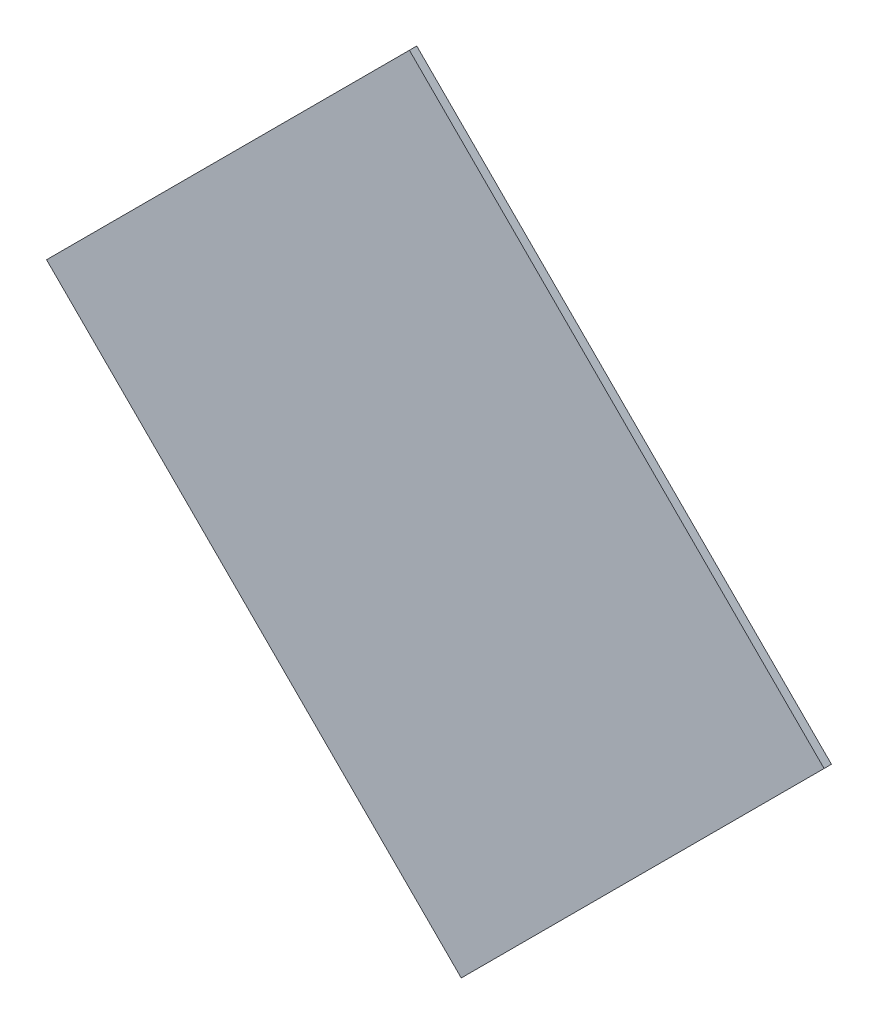
ISO-10303-21;
HEADER;
FILE_DESCRIPTION(('STEP AP214'),'2;1');
FILE_NAME('part.step','',(''),(''),'','','');
FILE_SCHEMA(('AUTOMOTIVE_DESIGN { 1 0 10303 214 1 1 1 1 }'));
ENDSEC;
DATA;
#1=APPLICATION_CONTEXT('core data for automotive mechanical design processes');
#2=APPLICATION_PROTOCOL_DEFINITION('international standard','automotive_design',2000,#1);
#3=PRODUCT_CONTEXT('',#1,'mechanical');
#4=PRODUCT('Part','Part','',(#3));
#5=PRODUCT_RELATED_PRODUCT_CATEGORY('part','',(#4));
#6=PRODUCT_DEFINITION_FORMATION('','',#4);
#7=PRODUCT_DEFINITION_CONTEXT('part definition',#1,'design');
#8=PRODUCT_DEFINITION('design','',#6,#7);
#9=PRODUCT_DEFINITION_SHAPE('','',#8);
#10=(LENGTH_UNIT() NAMED_UNIT(*) SI_UNIT(.MILLI.,.METRE.));
#11=(NAMED_UNIT(*) PLANE_ANGLE_UNIT() SI_UNIT($,.RADIAN.));
#12=(NAMED_UNIT(*) SI_UNIT($,.STERADIAN.) SOLID_ANGLE_UNIT());
#13=UNCERTAINTY_MEASURE_WITH_UNIT(LENGTH_MEASURE(1.E-05),#10,'distance_accuracy_value','');
#14=(GEOMETRIC_REPRESENTATION_CONTEXT(3) GLOBAL_UNCERTAINTY_ASSIGNED_CONTEXT((#13)) GLOBAL_UNIT_ASSIGNED_CONTEXT((#10,
#11,#12)) REPRESENTATION_CONTEXT('',''));
#15=CARTESIAN_POINT('',(0.,0.,0.));
#16=DIRECTION('',(0.,0.,1.));
#17=DIRECTION('',(1.,0.,0.));
#18=AXIS2_PLACEMENT_3D('',#15,#16,#17);
#19=CARTESIAN_POINT('',(9.899999999999,7.928329999999,0.80916));
#20=DIRECTION('',(-1.450297221417E-10,-1.450297221417E-10,1.));
#21=DIRECTION('',(1.,0.,1.450297221417E-10));
#22=AXIS2_PLACEMENT_3D('',#19,#20,#21);
#23=PLANE('',#22);
#24=DIRECTION('',(0.707106781186548,0.707106781186548,0.));
#25=VECTOR('',#24,1.);
#26=CARTESIAN_POINT('',(9.581801948465,6.620182454803,0.809159999908));
#27=LINE('',#26,#25);
#28=CARTESIAN_POINT('',(10.0767766952955,7.11515720163425,0.809159999907926));
#29=VERTEX_POINT('',#28);
#30=CARTESIAN_POINT('',(9.58180194846488,6.62018245480313,0.809159999836033));
#31=VERTEX_POINT('',#30);
#32=EDGE_CURVE('E55',#29,#31,#27,.F.);
#33=ORIENTED_EDGE('',*,*,#32,.T.);
#34=DIRECTION('',(-0.707106781186548,0.707106781186548,0.));
#35=VECTOR('',#34,1.);
#36=CARTESIAN_POINT('',(10.147487373414,6.054497029854,0.809159999764));
#37=LINE('',#36,#35);
#38=CARTESIAN_POINT('',(10.1474873734144,6.05449702985437,0.809159999764033));
#39=VERTEX_POINT('',#38);
#40=EDGE_CURVE('E76',#31,#39,#37,.F.);
#41=ORIENTED_EDGE('',*,*,#40,.T.);
#42=DIRECTION('',(-0.707106781186548,-0.707106781186548,0.));
#43=VECTOR('',#42,1.);
#44=CARTESIAN_POINT('',(10.147487373414,6.054497029854,0.809159999764));
#45=LINE('',#44,#43);
#46=CARTESIAN_POINT('',(10.6424621202443,6.54947177668475,0.809159999871852));
#47=VERTEX_POINT('',#46);
#48=EDGE_CURVE('E58',#39,#47,#45,.F.);
#49=ORIENTED_EDGE('',*,*,#48,.T.);
#50=DIRECTION('',(0.707106781186548,-0.707106781186548,0.));
#51=VECTOR('',#50,1.);
#52=CARTESIAN_POINT('',(10.642462120244,6.549471776685,0.809159999908));
#53=LINE('',#52,#51);
#54=EDGE_CURVE('E20',#47,#29,#53,.F.);
#55=ORIENTED_EDGE('',*,*,#54,.T.);
#56=EDGE_LOOP('',(#33,#41,#49,#55));
#57=FACE_BOUND('',#56,.T.);
#58=ADVANCED_FACE('F17',(#57),#23,.T.);
#59=CARTESIAN_POINT('',(10.642462120244,6.549471776685,0.809159999908));
#60=DIRECTION('',(-0.707106781186548,-0.707106781186548,-2.05102999999869E-10));
#61=DIRECTION('',(0.707106781186548,-0.707106781186548,0.));
#62=AXIS2_PLACEMENT_3D('',#59,#60,#61);
#63=PLANE('',#62);
#64=DIRECTION('',(0.,0.,1.));
#65=VECTOR('',#64,1.);
#66=CARTESIAN_POINT('',(10.076776695297,7.115157201635,0.809159999764));
#67=LINE('',#66,#65);
#68=CARTESIAN_POINT('',(10.0767766952967,7.11515720163522,0.799159999871926));
#69=VERTEX_POINT('',#68);
#70=EDGE_CURVE('E63',#69,#29,#67,.T.);
#71=ORIENTED_EDGE('',*,*,#70,.T.);
#72=ORIENTED_EDGE('',*,*,#54,.F.);
#73=DIRECTION('',(0.,0.,1.));
#74=VECTOR('',#73,1.);
#75=CARTESIAN_POINT('',(10.6424621202445,6.5494717766845,0.809159999764));
#76=LINE('',#75,#74);
#77=CARTESIAN_POINT('',(10.6424621202456,6.5494717766856,0.799159999907926));
#78=VERTEX_POINT('',#77);
#79=EDGE_CURVE('E80',#47,#78,#76,.F.);
#80=ORIENTED_EDGE('',*,*,#79,.T.);
#81=DIRECTION('',(-0.707106781186548,0.707106781186547,0.));
#82=VECTOR('',#81,1.);
#83=CARTESIAN_POINT('',(10.642462120246,6.549471776686,0.799159999907704));
#84=LINE('',#83,#82);
#85=EDGE_CURVE('E73',#78,#69,#84,.T.);
#86=ORIENTED_EDGE('',*,*,#85,.T.);
#87=EDGE_LOOP('',(#71,#72,#80,#86));
#88=FACE_BOUND('',#87,.T.);
#89=ADVANCED_FACE('F72',(#88),#63,.F.);
#90=CARTESIAN_POINT('',(9.581801948465,6.620182454803,0.809159999764));
#91=DIRECTION('',(0.707106781186548,-0.707106781186548,0.));
#92=DIRECTION('',(0.707106781186548,0.707106781186548,0.));
#93=AXIS2_PLACEMENT_3D('',#90,#91,#92);
#94=PLANE('',#93);
#95=DIRECTION('',(-1.45029722141612E-10,-1.45029722141612E-10,1.));
#96=VECTOR('',#95,1.);
#97=CARTESIAN_POINT('',(9.5818019484645,6.6201824548035,0.809159999764));
#98=LINE('',#97,#96);
#99=CARTESIAN_POINT('',(9.58180194846549,6.62018245480399,0.799159999764033));
#100=VERTEX_POINT('',#99);
#101=EDGE_CURVE('E69',#100,#31,#98,.T.);
#102=ORIENTED_EDGE('',*,*,#101,.T.);
#103=ORIENTED_EDGE('',*,*,#32,.F.);
#104=ORIENTED_EDGE('',*,*,#70,.F.);
#105=DIRECTION('',(-0.707106781187262,-0.707106781185833,-2.05103171549857E-10));
#106=VECTOR('',#105,1.);
#107=CARTESIAN_POINT('',(10.076776695297,7.115157201635,0.799159999907704));
#108=LINE('',#107,#106);
#109=EDGE_CURVE('E83',#69,#100,#108,.T.);
#110=ORIENTED_EDGE('',*,*,#109,.T.);
#111=EDGE_LOOP('',(#102,#103,#104,#110));
#112=FACE_BOUND('',#111,.T.);
#113=ADVANCED_FACE('F66',(#112),#94,.F.);
#114=CARTESIAN_POINT('',(10.147487373414,6.054497029854,0.809159999764));
#115=DIRECTION('',(0.707106781186548,0.707106781186548,2.05102999999869E-10));
#116=DIRECTION('',(-0.707106781186548,0.707106781186548,0.));
#117=AXIS2_PLACEMENT_3D('',#114,#115,#116);
#118=PLANE('',#117);
#119=DIRECTION('',(0.,0.,1.));
#120=VECTOR('',#119,1.);
#121=CARTESIAN_POINT('',(10.1474873734155,6.0544970298555,0.809159999764));
#122=LINE('',#121,#120);
#123=CARTESIAN_POINT('',(10.1474873734154,6.0544970298556,0.799159999800033));
#124=VERTEX_POINT('',#123);
#125=EDGE_CURVE('E34',#124,#39,#122,.T.);
#126=ORIENTED_EDGE('',*,*,#125,.T.);
#127=ORIENTED_EDGE('',*,*,#40,.F.);
#128=ORIENTED_EDGE('',*,*,#101,.F.);
#129=DIRECTION('',(0.707106781186549,-0.707106781186546,0.));
#130=VECTOR('',#129,1.);
#131=CARTESIAN_POINT('',(9.581801948466,6.620182454805,0.799159999764132));
#132=LINE('',#131,#130);
#133=EDGE_CURVE('E26',#100,#124,#132,.T.);
#134=ORIENTED_EDGE('',*,*,#133,.T.);
#135=EDGE_LOOP('',(#126,#127,#128,#134));
#136=FACE_BOUND('',#135,.T.);
#137=ADVANCED_FACE('F88',(#136),#118,.F.);
#138=CARTESIAN_POINT('',(10.147487373414,6.054497029854,0.809159999764));
#139=DIRECTION('',(-0.707106781186548,0.707106781186548,0.));
#140=DIRECTION('',(-0.707106781186548,-0.707106781186548,0.));
#141=AXIS2_PLACEMENT_3D('',#138,#139,#140);
#142=PLANE('',#141);
#143=ORIENTED_EDGE('',*,*,#79,.F.);
#144=ORIENTED_EDGE('',*,*,#48,.F.);
#145=ORIENTED_EDGE('',*,*,#125,.F.);
#146=DIRECTION('',(0.707106781187262,0.707106781185832,2.05102861777807E-10));
#147=VECTOR('',#146,1.);
#148=CARTESIAN_POINT('',(10.147487373415,6.054497029856,0.799159999764132));
#149=LINE('',#148,#147);
#150=EDGE_CURVE('E11',#124,#78,#149,.T.);
#151=ORIENTED_EDGE('',*,*,#150,.T.);
#152=EDGE_LOOP('',(#143,#144,#145,#151));
#153=FACE_BOUND('',#152,.T.);
#154=ADVANCED_FACE('F91',(#153),#142,.F.);
#155=CARTESIAN_POINT('',(9.9,7.92833,0.79916));
#156=DIRECTION('',(-1.450297221417E-10,-1.450297221417E-10,1.));
#157=DIRECTION('',(1.,0.,1.450297221417E-10));
#158=AXIS2_PLACEMENT_3D('',#155,#156,#157);
#159=PLANE('',#158);
#160=ORIENTED_EDGE('',*,*,#133,.F.);
#161=ORIENTED_EDGE('',*,*,#109,.F.);
#162=ORIENTED_EDGE('',*,*,#85,.F.);
#163=ORIENTED_EDGE('',*,*,#150,.F.);
#164=EDGE_LOOP('',(#160,#161,#162,#163));
#165=FACE_BOUND('',#164,.T.);
#166=ADVANCED_FACE('F90',(#165),#159,.F.);
#167=CLOSED_SHELL('',(#58,#89,#113,#137,#154,#166));
#168=MANIFOLD_SOLID_BREP('B1',#167);
#169=ADVANCED_BREP_SHAPE_REPRESENTATION('',(#18,#168),#14);
#170=SHAPE_DEFINITION_REPRESENTATION(#9,#169);
ENDSEC;
END-ISO-10303-21;
